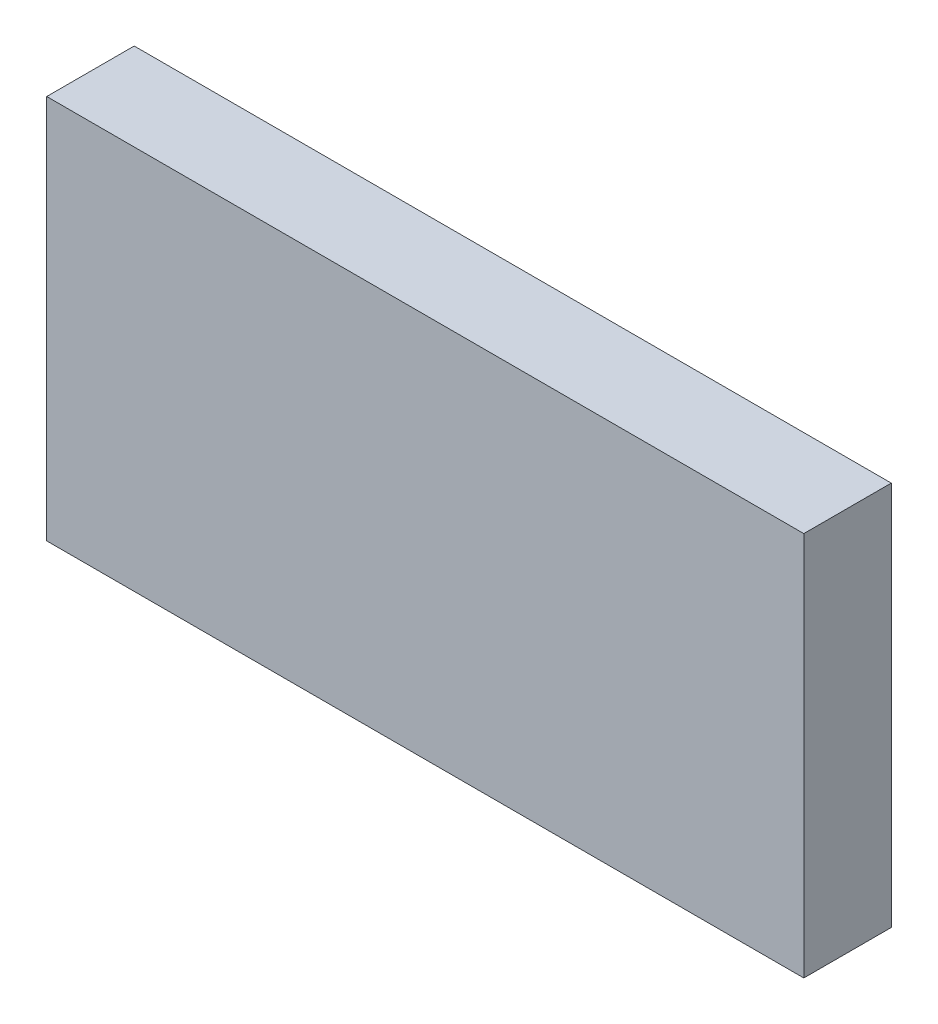
ISO-10303-21;
HEADER;
FILE_DESCRIPTION(('STEP AP214'),'2;1');
FILE_NAME('part.step','',(''),(''),'','','');
FILE_SCHEMA(('AUTOMOTIVE_DESIGN { 1 0 10303 214 1 1 1 1 }'));
ENDSEC;
DATA;
#1=APPLICATION_CONTEXT('core data for automotive mechanical design processes');
#2=APPLICATION_PROTOCOL_DEFINITION('international standard','automotive_design',2000,#1);
#3=PRODUCT_CONTEXT('',#1,'mechanical');
#4=PRODUCT('Part','Part','',(#3));
#5=PRODUCT_RELATED_PRODUCT_CATEGORY('part','',(#4));
#6=PRODUCT_DEFINITION_FORMATION('','',#4);
#7=PRODUCT_DEFINITION_CONTEXT('part definition',#1,'design');
#8=PRODUCT_DEFINITION('design','',#6,#7);
#9=PRODUCT_DEFINITION_SHAPE('','',#8);
#10=(LENGTH_UNIT() NAMED_UNIT(*) SI_UNIT(.MILLI.,.METRE.));
#11=(NAMED_UNIT(*) PLANE_ANGLE_UNIT() SI_UNIT($,.RADIAN.));
#12=(NAMED_UNIT(*) SI_UNIT($,.STERADIAN.) SOLID_ANGLE_UNIT());
#13=UNCERTAINTY_MEASURE_WITH_UNIT(LENGTH_MEASURE(1.E-05),#10,'distance_accuracy_value','');
#14=(GEOMETRIC_REPRESENTATION_CONTEXT(3) GLOBAL_UNCERTAINTY_ASSIGNED_CONTEXT((#13)) GLOBAL_UNIT_ASSIGNED_CONTEXT((#10,
#11,#12)) REPRESENTATION_CONTEXT('',''));
#15=CARTESIAN_POINT('',(0.,0.,0.));
#16=DIRECTION('',(0.,0.,1.));
#17=DIRECTION('',(1.,0.,0.));
#18=AXIS2_PLACEMENT_3D('',#15,#16,#17);
#19=CARTESIAN_POINT('',(-1.445,-0.62,0.));
#20=DIRECTION('',(1.,0.,0.));
#21=DIRECTION('',(0.,0.,1.));
#22=AXIS2_PLACEMENT_3D('',#19,#20,#21);
#23=PLANE('',#22);
#24=DIRECTION('',(0.,1.,0.));
#25=VECTOR('',#24,1.);
#26=CARTESIAN_POINT('',(-1.445,-0.62,0.1));
#27=LINE('',#26,#25);
#28=CARTESIAN_POINT('',(-1.445,-0.62,0.1));
#29=VERTEX_POINT('',#28);
#30=CARTESIAN_POINT('',(-1.445,-0.18,0.1));
#31=VERTEX_POINT('',#30);
#32=EDGE_CURVE('E11',#29,#31,#27,.T.);
#33=ORIENTED_EDGE('',*,*,#32,.T.);
#34=DIRECTION('',(0.,0.,1.));
#35=VECTOR('',#34,1.);
#36=CARTESIAN_POINT('',(-1.445,-0.18,0.));
#37=LINE('',#36,#35);
#38=CARTESIAN_POINT('',(-1.445,-0.18,0.));
#39=VERTEX_POINT('',#38);
#40=EDGE_CURVE('E24',#39,#31,#37,.T.);
#41=ORIENTED_EDGE('',*,*,#40,.F.);
#42=DIRECTION('',(0.,1.,0.));
#43=VECTOR('',#42,1.);
#44=CARTESIAN_POINT('',(-1.445,-0.62,0.));
#45=LINE('',#44,#43);
#46=CARTESIAN_POINT('',(-1.445,-0.62,0.));
#47=VERTEX_POINT('',#46);
#48=EDGE_CURVE('E86',#47,#39,#45,.T.);
#49=ORIENTED_EDGE('',*,*,#48,.F.);
#50=DIRECTION('',(0.,0.,1.));
#51=VECTOR('',#50,1.);
#52=CARTESIAN_POINT('',(-1.445,-0.62,0.));
#53=LINE('',#52,#51);
#54=EDGE_CURVE('E36',#47,#29,#53,.T.);
#55=ORIENTED_EDGE('',*,*,#54,.T.);
#56=EDGE_LOOP('',(#33,#41,#49,#55));
#57=FACE_BOUND('',#56,.T.);
#58=ADVANCED_FACE('F17',(#57),#23,.F.);
#59=CARTESIAN_POINT('',(-0.5795,-0.62,0.));
#60=DIRECTION('',(1.,0.,0.));
#61=DIRECTION('',(0.,0.,1.));
#62=AXIS2_PLACEMENT_3D('',#59,#60,#61);
#63=PLANE('',#62);
#64=DIRECTION('',(0.,0.,1.));
#65=VECTOR('',#64,1.);
#66=CARTESIAN_POINT('',(-0.5795,-0.62,0.));
#67=LINE('',#66,#65);
#68=CARTESIAN_POINT('',(-0.5795,-0.62,0.));
#69=VERTEX_POINT('',#68);
#70=CARTESIAN_POINT('',(-0.5795,-0.62,0.1));
#71=VERTEX_POINT('',#70);
#72=EDGE_CURVE('E83',#69,#71,#67,.T.);
#73=ORIENTED_EDGE('',*,*,#72,.F.);
#74=DIRECTION('',(0.,1.,0.));
#75=VECTOR('',#74,1.);
#76=CARTESIAN_POINT('',(-0.5795,-0.62,0.));
#77=LINE('',#76,#75);
#78=CARTESIAN_POINT('',(-0.5795,-0.18,0.));
#79=VERTEX_POINT('',#78);
#80=EDGE_CURVE('E63',#69,#79,#77,.T.);
#81=ORIENTED_EDGE('',*,*,#80,.T.);
#82=DIRECTION('',(0.,0.,1.));
#83=VECTOR('',#82,1.);
#84=CARTESIAN_POINT('',(-0.5795,-0.18,0.));
#85=LINE('',#84,#83);
#86=CARTESIAN_POINT('',(-0.5795,-0.18,0.1));
#87=VERTEX_POINT('',#86);
#88=EDGE_CURVE('E57',#79,#87,#85,.T.);
#89=ORIENTED_EDGE('',*,*,#88,.T.);
#90=DIRECTION('',(0.,1.,0.));
#91=VECTOR('',#90,1.);
#92=CARTESIAN_POINT('',(-0.5795,-0.62,0.1));
#93=LINE('',#92,#91);
#94=EDGE_CURVE('E60',#71,#87,#93,.T.);
#95=ORIENTED_EDGE('',*,*,#94,.F.);
#96=EDGE_LOOP('',(#73,#81,#89,#95));
#97=FACE_BOUND('',#96,.T.);
#98=ADVANCED_FACE('F59',(#97),#63,.T.);
#99=CARTESIAN_POINT('',(-1.445,-0.62,0.));
#100=DIRECTION('',(0.,1.,0.));
#101=DIRECTION('',(0.,0.,1.));
#102=AXIS2_PLACEMENT_3D('',#99,#100,#101);
#103=PLANE('',#102);
#104=ORIENTED_EDGE('',*,*,#72,.T.);
#105=DIRECTION('',(1.,0.,0.));
#106=VECTOR('',#105,1.);
#107=CARTESIAN_POINT('',(-1.445,-0.62,0.1));
#108=LINE('',#107,#106);
#109=EDGE_CURVE('E71',#29,#71,#108,.T.);
#110=ORIENTED_EDGE('',*,*,#109,.F.);
#111=ORIENTED_EDGE('',*,*,#54,.F.);
#112=DIRECTION('',(1.,0.,0.));
#113=VECTOR('',#112,1.);
#114=CARTESIAN_POINT('',(-1.445,-0.62,0.));
#115=LINE('',#114,#113);
#116=EDGE_CURVE('E76',#47,#69,#115,.T.);
#117=ORIENTED_EDGE('',*,*,#116,.T.);
#118=EDGE_LOOP('',(#104,#110,#111,#117));
#119=FACE_BOUND('',#118,.T.);
#120=ADVANCED_FACE('F91',(#119),#103,.F.);
#121=CARTESIAN_POINT('',(-1.445,-0.18,0.));
#122=DIRECTION('',(0.,1.,0.));
#123=DIRECTION('',(0.,0.,1.));
#124=AXIS2_PLACEMENT_3D('',#121,#122,#123);
#125=PLANE('',#124);
#126=DIRECTION('',(1.,0.,0.));
#127=VECTOR('',#126,1.);
#128=CARTESIAN_POINT('',(-1.445,-0.18,0.));
#129=LINE('',#128,#127);
#130=EDGE_CURVE('E74',#39,#79,#129,.T.);
#131=ORIENTED_EDGE('',*,*,#130,.F.);
#132=ORIENTED_EDGE('',*,*,#40,.T.);
#133=DIRECTION('',(1.,0.,0.));
#134=VECTOR('',#133,1.);
#135=CARTESIAN_POINT('',(-1.445,-0.18,0.1));
#136=LINE('',#135,#134);
#137=EDGE_CURVE('E69',#31,#87,#136,.T.);
#138=ORIENTED_EDGE('',*,*,#137,.T.);
#139=ORIENTED_EDGE('',*,*,#88,.F.);
#140=EDGE_LOOP('',(#131,#132,#138,#139));
#141=FACE_BOUND('',#140,.T.);
#142=ADVANCED_FACE('F73',(#141),#125,.T.);
#143=CARTESIAN_POINT('',(-1.445,-0.62,0.));
#144=DIRECTION('',(0.,0.,1.));
#145=DIRECTION('',(1.,0.,0.));
#146=AXIS2_PLACEMENT_3D('',#143,#144,#145);
#147=PLANE('',#146);
#148=ORIENTED_EDGE('',*,*,#130,.T.);
#149=ORIENTED_EDGE('',*,*,#80,.F.);
#150=ORIENTED_EDGE('',*,*,#116,.F.);
#151=ORIENTED_EDGE('',*,*,#48,.T.);
#152=EDGE_LOOP('',(#148,#149,#150,#151));
#153=FACE_BOUND('',#152,.T.);
#154=ADVANCED_FACE('F89',(#153),#147,.F.);
#155=CARTESIAN_POINT('',(-1.445,-0.62,0.1));
#156=DIRECTION('',(0.,0.,1.));
#157=DIRECTION('',(1.,0.,0.));
#158=AXIS2_PLACEMENT_3D('',#155,#156,#157);
#159=PLANE('',#158);
#160=ORIENTED_EDGE('',*,*,#32,.F.);
#161=ORIENTED_EDGE('',*,*,#109,.T.);
#162=ORIENTED_EDGE('',*,*,#94,.T.);
#163=ORIENTED_EDGE('',*,*,#137,.F.);
#164=EDGE_LOOP('',(#160,#161,#162,#163));
#165=FACE_BOUND('',#164,.T.);
#166=ADVANCED_FACE('F68',(#165),#159,.T.);
#167=CLOSED_SHELL('',(#58,#98,#120,#142,#154,#166));
#168=MANIFOLD_SOLID_BREP('B1',#167);
#169=ADVANCED_BREP_SHAPE_REPRESENTATION('',(#18,#168),#14);
#170=SHAPE_DEFINITION_REPRESENTATION(#9,#169);
ENDSEC;
END-ISO-10303-21;
